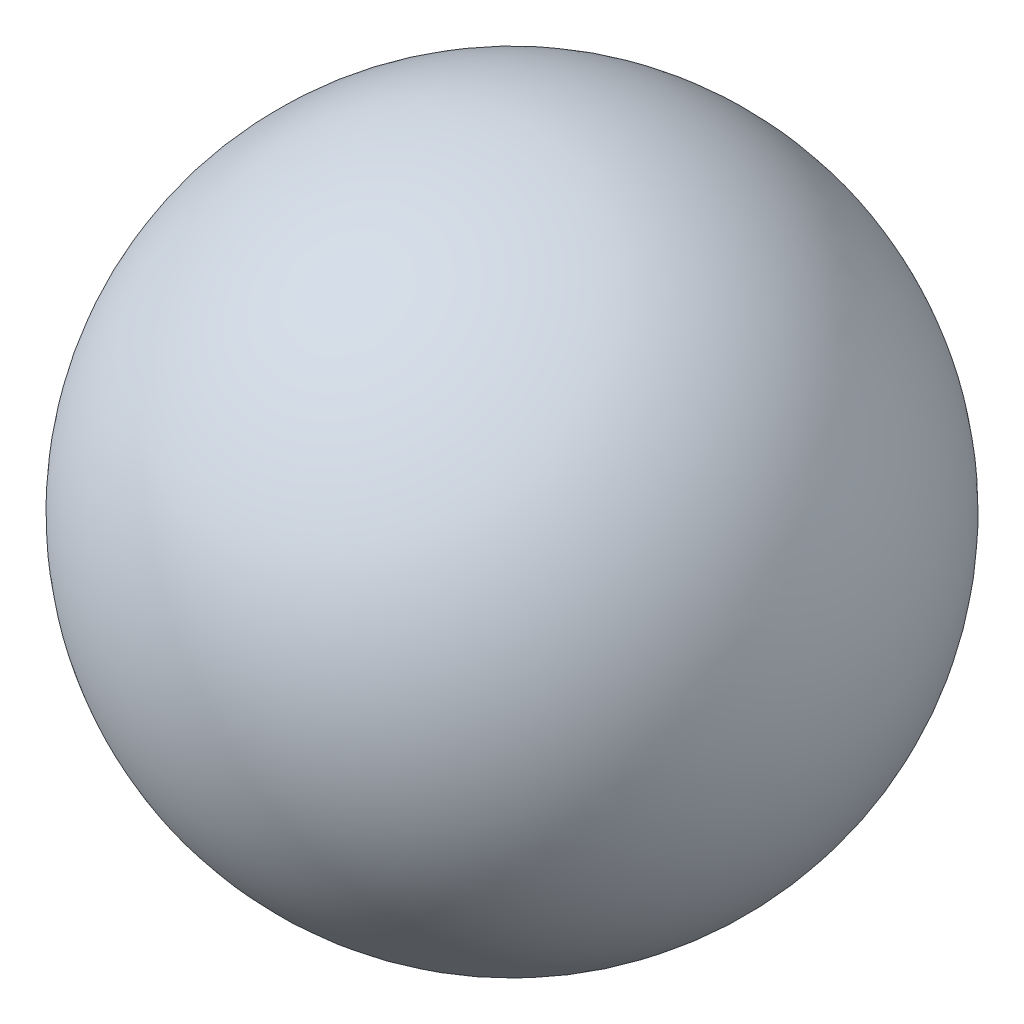
ISO-10303-21;
HEADER;
FILE_DESCRIPTION(('STEP AP214'),'2;1');
FILE_NAME('part.step','',(''),(''),'','','');
FILE_SCHEMA(('AUTOMOTIVE_DESIGN { 1 0 10303 214 1 1 1 1 }'));
ENDSEC;
DATA;
#1=APPLICATION_CONTEXT('core data for automotive mechanical design processes');
#2=APPLICATION_PROTOCOL_DEFINITION('international standard','automotive_design',2000,#1);
#3=PRODUCT_CONTEXT('',#1,'mechanical');
#4=PRODUCT('Part','Part','',(#3));
#5=PRODUCT_RELATED_PRODUCT_CATEGORY('part','',(#4));
#6=PRODUCT_DEFINITION_FORMATION('','',#4);
#7=PRODUCT_DEFINITION_CONTEXT('part definition',#1,'design');
#8=PRODUCT_DEFINITION('design','',#6,#7);
#9=PRODUCT_DEFINITION_SHAPE('','',#8);
#10=(LENGTH_UNIT() NAMED_UNIT(*) SI_UNIT(.MILLI.,.METRE.));
#11=(NAMED_UNIT(*) PLANE_ANGLE_UNIT() SI_UNIT($,.RADIAN.));
#12=(NAMED_UNIT(*) SI_UNIT($,.STERADIAN.) SOLID_ANGLE_UNIT());
#13=UNCERTAINTY_MEASURE_WITH_UNIT(LENGTH_MEASURE(1.E-05),#10,'distance_accuracy_value','');
#14=(GEOMETRIC_REPRESENTATION_CONTEXT(3) GLOBAL_UNCERTAINTY_ASSIGNED_CONTEXT((#13)) GLOBAL_UNIT_ASSIGNED_CONTEXT((#10,
#11,#12)) REPRESENTATION_CONTEXT('',''));
#15=CARTESIAN_POINT('',(0.,0.,0.));
#16=DIRECTION('',(0.,0.,1.));
#17=DIRECTION('',(1.,0.,0.));
#18=AXIS2_PLACEMENT_3D('',#15,#16,#17);
#19=CARTESIAN_POINT('',(-10.6881759454156,-2.,4.88112640277217));
#20=DIRECTION('',(0.,0.,1.));
#21=DIRECTION('',(1.,0.,0.));
#22=AXIS2_PLACEMENT_3D('',#19,#20,#21);
#23=SPHERICAL_SURFACE('',#22,1.05);
#24=CARTESIAN_POINT('',(-10.6881759454156,-2.,5.93112640277217));
#25=VERTEX_POINT('',#24);
#26=VERTEX_LOOP('',#25);
#27=FACE_BOUND('',#26,.T.);
#28=ADVANCED_FACE('F13',(#27),#23,.T.);
#29=CLOSED_SHELL('',(#28));
#30=MANIFOLD_SOLID_BREP('B1',#29);
#31=ADVANCED_BREP_SHAPE_REPRESENTATION('',(#18,#30),#14);
#32=SHAPE_DEFINITION_REPRESENTATION(#9,#31);
ENDSEC;
END-ISO-10303-21;
